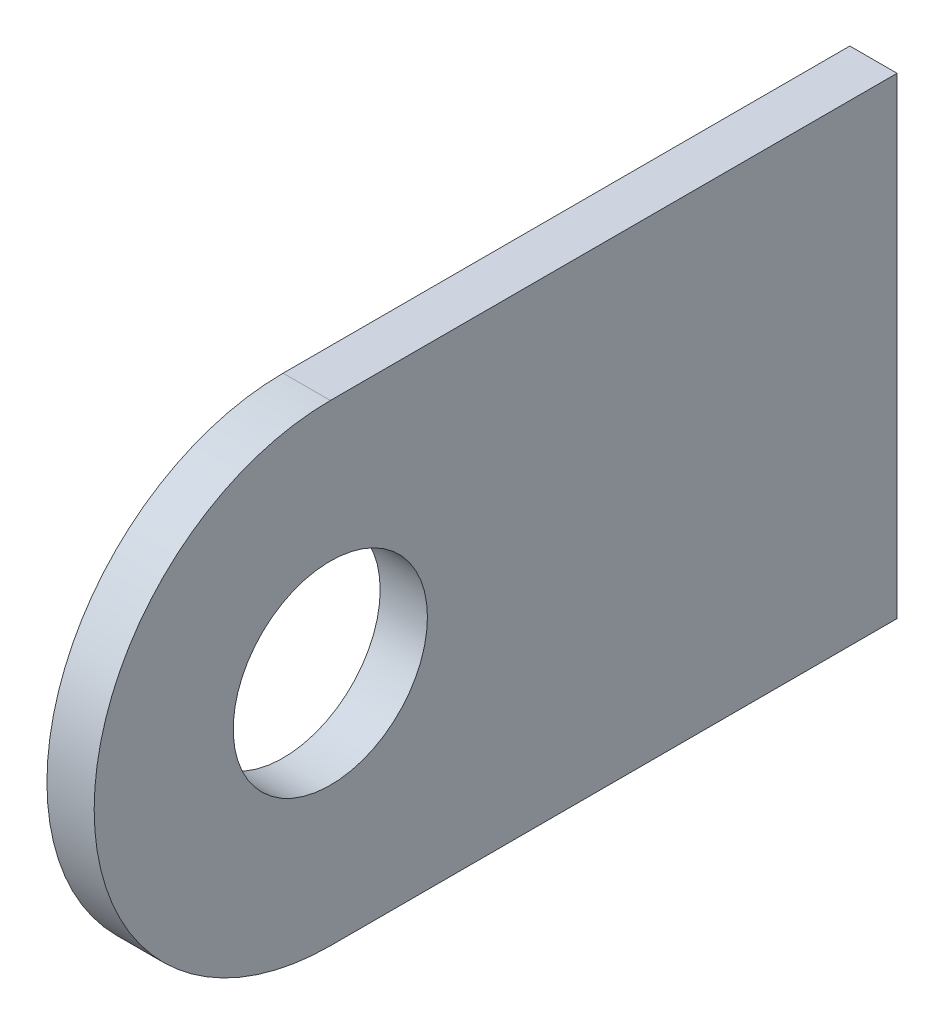
ISO-10303-21;
HEADER;
FILE_DESCRIPTION(('STEP AP214'),'2;1');
FILE_NAME('part.step','',(''),(''),'','','');
FILE_SCHEMA(('AUTOMOTIVE_DESIGN { 1 0 10303 214 1 1 1 1 }'));
ENDSEC;
DATA;
#1=APPLICATION_CONTEXT('core data for automotive mechanical design processes');
#2=APPLICATION_PROTOCOL_DEFINITION('international standard','automotive_design',2000,#1);
#3=PRODUCT_CONTEXT('',#1,'mechanical');
#4=PRODUCT('Part','Part','',(#3));
#5=PRODUCT_RELATED_PRODUCT_CATEGORY('part','',(#4));
#6=PRODUCT_DEFINITION_FORMATION('','',#4);
#7=PRODUCT_DEFINITION_CONTEXT('part definition',#1,'design');
#8=PRODUCT_DEFINITION('design','',#6,#7);
#9=PRODUCT_DEFINITION_SHAPE('','',#8);
#10=(LENGTH_UNIT() NAMED_UNIT(*) SI_UNIT(.MILLI.,.METRE.));
#11=(NAMED_UNIT(*) PLANE_ANGLE_UNIT() SI_UNIT($,.RADIAN.));
#12=(NAMED_UNIT(*) SI_UNIT($,.STERADIAN.) SOLID_ANGLE_UNIT());
#13=UNCERTAINTY_MEASURE_WITH_UNIT(LENGTH_MEASURE(1.E-05),#10,'distance_accuracy_value','');
#14=(GEOMETRIC_REPRESENTATION_CONTEXT(3) GLOBAL_UNCERTAINTY_ASSIGNED_CONTEXT((#13)) GLOBAL_UNIT_ASSIGNED_CONTEXT((#10,
#11,#12)) REPRESENTATION_CONTEXT('',''));
#15=CARTESIAN_POINT('',(0.,0.,0.));
#16=DIRECTION('',(0.,0.,1.));
#17=DIRECTION('',(1.,0.,0.));
#18=AXIS2_PLACEMENT_3D('',#15,#16,#17);
#19=CARTESIAN_POINT('',(1.5875,7.93749999999761,15.875));
#20=DIRECTION('',(0.,-1.,0.));
#21=DIRECTION('',(0.,0.,-1.));
#22=AXIS2_PLACEMENT_3D('',#19,#20,#21);
#23=PLANE('',#22);
#24=DIRECTION('',(0.,0.,1.));
#25=VECTOR('',#24,1.);
#26=CARTESIAN_POINT('',(0.,7.93749999999761,15.875));
#27=LINE('',#26,#25);
#28=CARTESIAN_POINT('',(0.,7.9374999999976,-3.175));
#29=VERTEX_POINT('',#28);
#30=CARTESIAN_POINT('',(0.,7.93749999999761,15.875));
#31=VERTEX_POINT('',#30);
#32=EDGE_CURVE('E98',#29,#31,#27,.T.);
#33=ORIENTED_EDGE('',*,*,#32,.T.);
#34=DIRECTION('',(-1.,0.,0.));
#35=VECTOR('',#34,1.);
#36=CARTESIAN_POINT('',(1.5875,7.93749999999761,15.875));
#37=LINE('',#36,#35);
#38=CARTESIAN_POINT('',(1.5875,7.93749999999761,15.875));
#39=VERTEX_POINT('',#38);
#40=EDGE_CURVE('E11',#39,#31,#37,.T.);
#41=ORIENTED_EDGE('',*,*,#40,.F.);
#42=DIRECTION('',(0.,0.,1.));
#43=VECTOR('',#42,1.);
#44=CARTESIAN_POINT('',(1.5875,7.93749999999761,15.875));
#45=LINE('',#44,#43);
#46=CARTESIAN_POINT('',(1.5875,7.9374999999976,-3.175));
#47=VERTEX_POINT('',#46);
#48=EDGE_CURVE('E86',#47,#39,#45,.T.);
#49=ORIENTED_EDGE('',*,*,#48,.F.);
#50=DIRECTION('',(-1.,0.,0.));
#51=VECTOR('',#50,1.);
#52=CARTESIAN_POINT('',(1.5875,7.9374999999976,-3.175));
#53=LINE('',#52,#51);
#54=EDGE_CURVE('E94',#47,#29,#53,.T.);
#55=ORIENTED_EDGE('',*,*,#54,.T.);
#56=EDGE_LOOP('',(#33,#41,#49,#55));
#57=FACE_BOUND('',#56,.T.);
#58=ADVANCED_FACE('F35',(#57),#23,.F.);
#59=CARTESIAN_POINT('',(1.5875,0.,15.875));
#60=DIRECTION('',(-1.,0.,0.));
#61=DIRECTION('',(0.,0.,1.));
#62=AXIS2_PLACEMENT_3D('',#59,#60,#61);
#63=CYLINDRICAL_SURFACE('',#62,7.93749999999761);
#64=CARTESIAN_POINT('',(0.,0.,15.875));
#65=DIRECTION('',(1.,0.,0.));
#66=DIRECTION('',(0.,0.,1.));
#67=AXIS2_PLACEMENT_3D('',#64,#65,#66);
#68=CIRCLE('',#67,7.93749999999761);
#69=CARTESIAN_POINT('',(0.,-7.93749999999761,15.875));
#70=VERTEX_POINT('',#69);
#71=EDGE_CURVE('E90',#31,#70,#68,.T.);
#72=ORIENTED_EDGE('',*,*,#71,.T.);
#73=DIRECTION('',(-1.,0.,0.));
#74=VECTOR('',#73,1.);
#75=CARTESIAN_POINT('',(1.5875,-7.93749999999761,15.875));
#76=LINE('',#75,#74);
#77=CARTESIAN_POINT('',(1.5875,-7.93749999999761,15.875));
#78=VERTEX_POINT('',#77);
#79=EDGE_CURVE('E43',#78,#70,#76,.T.);
#80=ORIENTED_EDGE('',*,*,#79,.F.);
#81=CARTESIAN_POINT('',(1.5875,0.,15.875));
#82=DIRECTION('',(1.,0.,0.));
#83=DIRECTION('',(0.,0.,1.));
#84=AXIS2_PLACEMENT_3D('',#81,#82,#83);
#85=CIRCLE('',#84,7.93749999999761);
#86=EDGE_CURVE('E81',#39,#78,#85,.T.);
#87=ORIENTED_EDGE('',*,*,#86,.F.);
#88=ORIENTED_EDGE('',*,*,#40,.T.);
#89=EDGE_LOOP('',(#72,#80,#87,#88));
#90=FACE_BOUND('',#89,.T.);
#91=ADVANCED_FACE('F89',(#90),#63,.T.);
#92=CARTESIAN_POINT('',(1.5875,-7.93749999999761,15.875));
#93=DIRECTION('',(0.,1.,0.));
#94=DIRECTION('',(0.,0.,1.));
#95=AXIS2_PLACEMENT_3D('',#92,#93,#94);
#96=PLANE('',#95);
#97=DIRECTION('',(0.,0.,-1.));
#98=VECTOR('',#97,1.);
#99=CARTESIAN_POINT('',(0.,-7.93749999999761,15.875));
#100=LINE('',#99,#98);
#101=CARTESIAN_POINT('',(0.,-7.93749999999761,-3.175));
#102=VERTEX_POINT('',#101);
#103=EDGE_CURVE('E68',#70,#102,#100,.T.);
#104=ORIENTED_EDGE('',*,*,#103,.T.);
#105=DIRECTION('',(-1.,0.,0.));
#106=VECTOR('',#105,1.);
#107=CARTESIAN_POINT('',(1.5875,-7.93749999999761,-3.175));
#108=LINE('',#107,#106);
#109=CARTESIAN_POINT('',(1.5875,-7.93749999999761,-3.175));
#110=VERTEX_POINT('',#109);
#111=EDGE_CURVE('E91',#110,#102,#108,.T.);
#112=ORIENTED_EDGE('',*,*,#111,.F.);
#113=DIRECTION('',(0.,0.,-1.));
#114=VECTOR('',#113,1.);
#115=CARTESIAN_POINT('',(1.5875,-7.93749999999761,15.875));
#116=LINE('',#115,#114);
#117=EDGE_CURVE('E84',#78,#110,#116,.T.);
#118=ORIENTED_EDGE('',*,*,#117,.F.);
#119=ORIENTED_EDGE('',*,*,#79,.T.);
#120=EDGE_LOOP('',(#104,#112,#118,#119));
#121=FACE_BOUND('',#120,.T.);
#122=ADVANCED_FACE('F92',(#121),#96,.F.);
#123=CARTESIAN_POINT('',(1.5875,-7.93749999999761,-3.175));
#124=DIRECTION('',(0.,0.,1.));
#125=DIRECTION('',(1.,0.,0.));
#126=AXIS2_PLACEMENT_3D('',#123,#124,#125);
#127=PLANE('',#126);
#128=DIRECTION('',(0.,1.,0.));
#129=VECTOR('',#128,1.);
#130=CARTESIAN_POINT('',(0.,-7.93749999999761,-3.175));
#131=LINE('',#130,#129);
#132=EDGE_CURVE('E74',#102,#29,#131,.T.);
#133=ORIENTED_EDGE('',*,*,#132,.T.);
#134=ORIENTED_EDGE('',*,*,#54,.F.);
#135=DIRECTION('',(0.,1.,0.));
#136=VECTOR('',#135,1.);
#137=CARTESIAN_POINT('',(1.5875,-7.93749999999761,-3.175));
#138=LINE('',#137,#136);
#139=EDGE_CURVE('E51',#110,#47,#138,.T.);
#140=ORIENTED_EDGE('',*,*,#139,.F.);
#141=ORIENTED_EDGE('',*,*,#111,.T.);
#142=EDGE_LOOP('',(#133,#134,#140,#141));
#143=FACE_BOUND('',#142,.T.);
#144=ADVANCED_FACE('F106',(#143),#127,.F.);
#145=CARTESIAN_POINT('',(1.5875,0.,15.875));
#146=DIRECTION('',(-1.,0.,0.));
#147=DIRECTION('',(0.,0.,1.));
#148=AXIS2_PLACEMENT_3D('',#145,#146,#147);
#149=PLANE('',#148);
#150=CARTESIAN_POINT('',(1.5875,0.,15.875));
#151=DIRECTION('',(1.,0.,0.));
#152=DIRECTION('',(0.,0.,-1.));
#153=AXIS2_PLACEMENT_3D('',#150,#151,#152);
#154=CIRCLE('',#153,3.2639);
#155=CARTESIAN_POINT('',(1.5875,0.,12.6111));
#156=VERTEX_POINT('',#155);
#157=EDGE_CURVE('E114',#156,#156,#154,.T.);
#158=ORIENTED_EDGE('',*,*,#157,.F.);
#159=EDGE_LOOP('',(#158));
#160=FACE_BOUND('',#159,.T.);
#161=ORIENTED_EDGE('',*,*,#48,.T.);
#162=ORIENTED_EDGE('',*,*,#86,.T.);
#163=ORIENTED_EDGE('',*,*,#117,.T.);
#164=ORIENTED_EDGE('',*,*,#139,.T.);
#165=EDGE_LOOP('',(#161,#162,#163,#164));
#166=FACE_BOUND('',#165,.T.);
#167=ADVANCED_FACE('F82',(#160,#166),#149,.F.);
#168=CARTESIAN_POINT('',(0.,0.,15.875));
#169=DIRECTION('',(-1.,0.,0.));
#170=DIRECTION('',(0.,0.,1.));
#171=AXIS2_PLACEMENT_3D('',#168,#169,#170);
#172=PLANE('',#171);
#173=CARTESIAN_POINT('',(0.,0.,15.875));
#174=DIRECTION('',(1.,0.,0.));
#175=DIRECTION('',(0.,0.,-1.));
#176=AXIS2_PLACEMENT_3D('',#173,#174,#175);
#177=CIRCLE('',#176,3.2639);
#178=CARTESIAN_POINT('',(0.,0.,12.6111));
#179=VERTEX_POINT('',#178);
#180=EDGE_CURVE('E101',#179,#179,#177,.T.);
#181=ORIENTED_EDGE('',*,*,#180,.T.);
#182=EDGE_LOOP('',(#181));
#183=FACE_BOUND('',#182,.T.);
#184=ORIENTED_EDGE('',*,*,#32,.F.);
#185=ORIENTED_EDGE('',*,*,#132,.F.);
#186=ORIENTED_EDGE('',*,*,#103,.F.);
#187=ORIENTED_EDGE('',*,*,#71,.F.);
#188=EDGE_LOOP('',(#184,#185,#186,#187));
#189=FACE_BOUND('',#188,.T.);
#190=ADVANCED_FACE('F109',(#183,#189),#172,.T.);
#191=CARTESIAN_POINT('',(1.5875,0.,15.875));
#192=DIRECTION('',(1.,0.,0.));
#193=DIRECTION('',(0.,0.,-1.));
#194=AXIS2_PLACEMENT_3D('',#191,#192,#193);
#195=CYLINDRICAL_SURFACE('',#194,3.2639);
#196=ORIENTED_EDGE('',*,*,#180,.F.);
#197=EDGE_LOOP('',(#196));
#198=FACE_BOUND('',#197,.T.);
#199=ORIENTED_EDGE('',*,*,#157,.T.);
#200=EDGE_LOOP('',(#199));
#201=FACE_BOUND('',#200,.T.);
#202=ADVANCED_FACE('F118',(#198,#201),#195,.F.);
#203=CLOSED_SHELL('',(#58,#91,#122,#144,#167,#190,#202));
#204=MANIFOLD_SOLID_BREP('B2',#203);
#205=ADVANCED_BREP_SHAPE_REPRESENTATION('',(#18,#204),#14);
#206=SHAPE_DEFINITION_REPRESENTATION(#9,#205);
ENDSEC;
END-ISO-10303-21;
